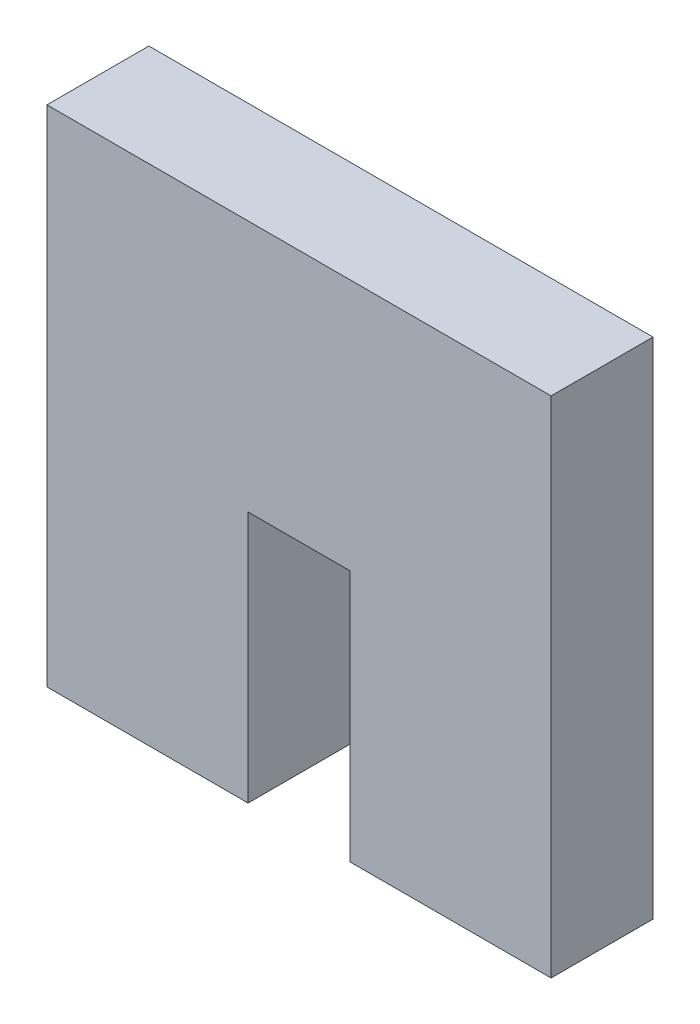
ISO-10303-21;
HEADER;
FILE_DESCRIPTION(('STEP AP214'),'2;1');
FILE_NAME('part.step','',(''),(''),'','','');
FILE_SCHEMA(('AUTOMOTIVE_DESIGN { 1 0 10303 214 1 1 1 1 }'));
ENDSEC;
DATA;
#1=APPLICATION_CONTEXT('core data for automotive mechanical design processes');
#2=APPLICATION_PROTOCOL_DEFINITION('international standard','automotive_design',2000,#1);
#3=PRODUCT_CONTEXT('',#1,'mechanical');
#4=PRODUCT('Part','Part','',(#3));
#5=PRODUCT_RELATED_PRODUCT_CATEGORY('part','',(#4));
#6=PRODUCT_DEFINITION_FORMATION('','',#4);
#7=PRODUCT_DEFINITION_CONTEXT('part definition',#1,'design');
#8=PRODUCT_DEFINITION('design','',#6,#7);
#9=PRODUCT_DEFINITION_SHAPE('','',#8);
#10=(LENGTH_UNIT() NAMED_UNIT(*) SI_UNIT(.MILLI.,.METRE.));
#11=(NAMED_UNIT(*) PLANE_ANGLE_UNIT() SI_UNIT($,.RADIAN.));
#12=(NAMED_UNIT(*) SI_UNIT($,.STERADIAN.) SOLID_ANGLE_UNIT());
#13=UNCERTAINTY_MEASURE_WITH_UNIT(LENGTH_MEASURE(1.E-05),#10,'distance_accuracy_value','');
#14=(GEOMETRIC_REPRESENTATION_CONTEXT(3) GLOBAL_UNCERTAINTY_ASSIGNED_CONTEXT((#13)) GLOBAL_UNIT_ASSIGNED_CONTEXT((#10,
#11,#12)) REPRESENTATION_CONTEXT('',''));
#15=CARTESIAN_POINT('',(0.,0.,0.));
#16=DIRECTION('',(0.,0.,1.));
#17=DIRECTION('',(1.,0.,0.));
#18=AXIS2_PLACEMENT_3D('',#15,#16,#17);
#19=CARTESIAN_POINT('',(0.,0.,4.318));
#20=DIRECTION('',(1.,0.,0.));
#21=DIRECTION('',(0.,0.,-1.));
#22=AXIS2_PLACEMENT_3D('',#19,#20,#21);
#23=PLANE('',#22);
#24=DIRECTION('',(0.,-1.,0.));
#25=VECTOR('',#24,1.);
#26=CARTESIAN_POINT('',(0.,0.,0.));
#27=LINE('',#26,#25);
#28=CARTESIAN_POINT('',(0.,21.36,0.));
#29=VERTEX_POINT('',#28);
#30=CARTESIAN_POINT('',(0.,0.,0.));
#31=VERTEX_POINT('',#30);
#32=EDGE_CURVE('E129',#29,#31,#27,.T.);
#33=ORIENTED_EDGE('',*,*,#32,.T.);
#34=DIRECTION('',(0.,0.,-1.));
#35=VECTOR('',#34,1.);
#36=CARTESIAN_POINT('',(0.,0.,4.318));
#37=LINE('',#36,#35);
#38=CARTESIAN_POINT('',(0.,0.,4.318));
#39=VERTEX_POINT('',#38);
#40=EDGE_CURVE('E11',#39,#31,#37,.T.);
#41=ORIENTED_EDGE('',*,*,#40,.F.);
#42=DIRECTION('',(0.,-1.,0.));
#43=VECTOR('',#42,1.);
#44=CARTESIAN_POINT('',(0.,0.,4.318));
#45=LINE('',#44,#43);
#46=CARTESIAN_POINT('',(0.,21.36,4.318));
#47=VERTEX_POINT('',#46);
#48=EDGE_CURVE('E143',#47,#39,#45,.T.);
#49=ORIENTED_EDGE('',*,*,#48,.F.);
#50=DIRECTION('',(0.,0.,-1.));
#51=VECTOR('',#50,1.);
#52=CARTESIAN_POINT('',(0.,21.36,4.318));
#53=LINE('',#52,#51);
#54=EDGE_CURVE('E125',#47,#29,#53,.T.);
#55=ORIENTED_EDGE('',*,*,#54,.T.);
#56=EDGE_LOOP('',(#33,#41,#49,#55));
#57=FACE_BOUND('',#56,.T.);
#58=ADVANCED_FACE('F33',(#57),#23,.F.);
#59=CARTESIAN_POINT('',(0.,0.,4.318));
#60=DIRECTION('',(0.,1.,0.));
#61=DIRECTION('',(0.,0.,1.));
#62=AXIS2_PLACEMENT_3D('',#59,#60,#61);
#63=PLANE('',#62);
#64=DIRECTION('',(1.,0.,0.));
#65=VECTOR('',#64,1.);
#66=CARTESIAN_POINT('',(0.,0.,0.));
#67=LINE('',#66,#65);
#68=CARTESIAN_POINT('',(8.521,0.,0.));
#69=VERTEX_POINT('',#68);
#70=EDGE_CURVE('E132',#31,#69,#67,.T.);
#71=ORIENTED_EDGE('',*,*,#70,.T.);
#72=DIRECTION('',(0.,0.,-1.));
#73=VECTOR('',#72,1.);
#74=CARTESIAN_POINT('',(8.521,0.,4.318));
#75=LINE('',#74,#73);
#76=CARTESIAN_POINT('',(8.521,0.,4.318));
#77=VERTEX_POINT('',#76);
#78=EDGE_CURVE('E41',#77,#69,#75,.T.);
#79=ORIENTED_EDGE('',*,*,#78,.F.);
#80=DIRECTION('',(1.,0.,0.));
#81=VECTOR('',#80,1.);
#82=CARTESIAN_POINT('',(0.,0.,4.318));
#83=LINE('',#82,#81);
#84=EDGE_CURVE('E92',#39,#77,#83,.T.);
#85=ORIENTED_EDGE('',*,*,#84,.F.);
#86=ORIENTED_EDGE('',*,*,#40,.T.);
#87=EDGE_LOOP('',(#71,#79,#85,#86));
#88=FACE_BOUND('',#87,.T.);
#89=ADVANCED_FACE('F178',(#88),#63,.F.);
#90=CARTESIAN_POINT('',(8.521,0.,4.318));
#91=DIRECTION('',(-1.,0.,0.));
#92=DIRECTION('',(0.,0.,1.));
#93=AXIS2_PLACEMENT_3D('',#90,#91,#92);
#94=PLANE('',#93);
#95=DIRECTION('',(0.,1.,0.));
#96=VECTOR('',#95,1.);
#97=CARTESIAN_POINT('',(8.521,0.,0.));
#98=LINE('',#97,#96);
#99=CARTESIAN_POINT('',(8.521,10.68,0.));
#100=VERTEX_POINT('',#99);
#101=EDGE_CURVE('E134',#69,#100,#98,.T.);
#102=ORIENTED_EDGE('',*,*,#101,.T.);
#103=DIRECTION('',(0.,0.,-1.));
#104=VECTOR('',#103,1.);
#105=CARTESIAN_POINT('',(8.521,10.68,4.318));
#106=LINE('',#105,#104);
#107=CARTESIAN_POINT('',(8.521,10.68,4.318));
#108=VERTEX_POINT('',#107);
#109=EDGE_CURVE('E150',#108,#100,#106,.T.);
#110=ORIENTED_EDGE('',*,*,#109,.F.);
#111=DIRECTION('',(0.,1.,0.));
#112=VECTOR('',#111,1.);
#113=CARTESIAN_POINT('',(8.521,0.,4.318));
#114=LINE('',#113,#112);
#115=EDGE_CURVE('E158',#77,#108,#114,.T.);
#116=ORIENTED_EDGE('',*,*,#115,.F.);
#117=ORIENTED_EDGE('',*,*,#78,.T.);
#118=EDGE_LOOP('',(#102,#110,#116,#117));
#119=FACE_BOUND('',#118,.T.);
#120=ADVANCED_FACE('F156',(#119),#94,.F.);
#121=CARTESIAN_POINT('',(8.521,10.68,4.318));
#122=DIRECTION('',(0.,1.,0.));
#123=DIRECTION('',(-1.,0.,0.));
#124=AXIS2_PLACEMENT_3D('',#121,#122,#123);
#125=PLANE('',#124);
#126=DIRECTION('',(1.,0.,0.));
#127=VECTOR('',#126,1.);
#128=CARTESIAN_POINT('',(8.521,10.68,0.));
#129=LINE('',#128,#127);
#130=CARTESIAN_POINT('',(12.839,10.68,0.));
#131=VERTEX_POINT('',#130);
#132=EDGE_CURVE('E136',#100,#131,#129,.T.);
#133=ORIENTED_EDGE('',*,*,#132,.T.);
#134=DIRECTION('',(0.,0.,-1.));
#135=VECTOR('',#134,1.);
#136=CARTESIAN_POINT('',(12.839,10.68,4.318));
#137=LINE('',#136,#135);
#138=CARTESIAN_POINT('',(12.839,10.68,4.318));
#139=VERTEX_POINT('',#138);
#140=EDGE_CURVE('E147',#139,#131,#137,.T.);
#141=ORIENTED_EDGE('',*,*,#140,.F.);
#142=DIRECTION('',(1.,0.,0.));
#143=VECTOR('',#142,1.);
#144=CARTESIAN_POINT('',(8.521,10.68,4.318));
#145=LINE('',#144,#143);
#146=EDGE_CURVE('E170',#108,#139,#145,.T.);
#147=ORIENTED_EDGE('',*,*,#146,.F.);
#148=ORIENTED_EDGE('',*,*,#109,.T.);
#149=EDGE_LOOP('',(#133,#141,#147,#148));
#150=FACE_BOUND('',#149,.T.);
#151=ADVANCED_FACE('F166',(#150),#125,.F.);
#152=CARTESIAN_POINT('',(12.839,0.,4.318));
#153=DIRECTION('',(1.,0.,0.));
#154=DIRECTION('',(0.,1.,0.));
#155=AXIS2_PLACEMENT_3D('',#152,#153,#154);
#156=PLANE('',#155);
#157=DIRECTION('',(0.,-1.,0.));
#158=VECTOR('',#157,1.);
#159=CARTESIAN_POINT('',(12.839,0.,0.));
#160=LINE('',#159,#158);
#161=CARTESIAN_POINT('',(12.839,0.,0.));
#162=VERTEX_POINT('',#161);
#163=EDGE_CURVE('E138',#131,#162,#160,.T.);
#164=ORIENTED_EDGE('',*,*,#163,.T.);
#165=DIRECTION('',(0.,0.,-1.));
#166=VECTOR('',#165,1.);
#167=CARTESIAN_POINT('',(12.839,0.,4.318));
#168=LINE('',#167,#166);
#169=CARTESIAN_POINT('',(12.839,0.,4.318));
#170=VERTEX_POINT('',#169);
#171=EDGE_CURVE('E120',#170,#162,#168,.T.);
#172=ORIENTED_EDGE('',*,*,#171,.F.);
#173=DIRECTION('',(0.,-1.,0.));
#174=VECTOR('',#173,1.);
#175=CARTESIAN_POINT('',(12.839,0.,4.318));
#176=LINE('',#175,#174);
#177=EDGE_CURVE('E111',#139,#170,#176,.T.);
#178=ORIENTED_EDGE('',*,*,#177,.F.);
#179=ORIENTED_EDGE('',*,*,#140,.T.);
#180=EDGE_LOOP('',(#164,#172,#178,#179));
#181=FACE_BOUND('',#180,.T.);
#182=ADVANCED_FACE('F169',(#181),#156,.F.);
#183=CARTESIAN_POINT('',(12.839,0.,4.318));
#184=DIRECTION('',(0.,1.,0.));
#185=DIRECTION('',(0.,0.,1.));
#186=AXIS2_PLACEMENT_3D('',#183,#184,#185);
#187=PLANE('',#186);
#188=DIRECTION('',(1.,0.,0.));
#189=VECTOR('',#188,1.);
#190=CARTESIAN_POINT('',(12.839,0.,0.));
#191=LINE('',#190,#189);
#192=CARTESIAN_POINT('',(21.36,0.,0.));
#193=VERTEX_POINT('',#192);
#194=EDGE_CURVE('E119',#162,#193,#191,.T.);
#195=ORIENTED_EDGE('',*,*,#194,.T.);
#196=DIRECTION('',(0.,0.,-1.));
#197=VECTOR('',#196,1.);
#198=CARTESIAN_POINT('',(21.36,0.,4.318));
#199=LINE('',#198,#197);
#200=CARTESIAN_POINT('',(21.36,0.,4.318));
#201=VERTEX_POINT('',#200);
#202=EDGE_CURVE('E116',#201,#193,#199,.T.);
#203=ORIENTED_EDGE('',*,*,#202,.F.);
#204=DIRECTION('',(1.,0.,0.));
#205=VECTOR('',#204,1.);
#206=CARTESIAN_POINT('',(12.839,0.,4.318));
#207=LINE('',#206,#205);
#208=EDGE_CURVE('E105',#170,#201,#207,.T.);
#209=ORIENTED_EDGE('',*,*,#208,.F.);
#210=ORIENTED_EDGE('',*,*,#171,.T.);
#211=EDGE_LOOP('',(#195,#203,#209,#210));
#212=FACE_BOUND('',#211,.T.);
#213=ADVANCED_FACE('F117',(#212),#187,.F.);
#214=CARTESIAN_POINT('',(21.36,0.,4.318));
#215=DIRECTION('',(-1.,0.,0.));
#216=DIRECTION('',(0.,-1.,0.));
#217=AXIS2_PLACEMENT_3D('',#214,#215,#216);
#218=PLANE('',#217);
#219=DIRECTION('',(0.,1.,0.));
#220=VECTOR('',#219,1.);
#221=CARTESIAN_POINT('',(21.36,0.,0.));
#222=LINE('',#221,#220);
#223=CARTESIAN_POINT('',(21.36,21.36,0.));
#224=VERTEX_POINT('',#223);
#225=EDGE_CURVE('E78',#193,#224,#222,.T.);
#226=ORIENTED_EDGE('',*,*,#225,.T.);
#227=DIRECTION('',(0.,0.,-1.));
#228=VECTOR('',#227,1.);
#229=CARTESIAN_POINT('',(21.36,21.36,4.318));
#230=LINE('',#229,#228);
#231=CARTESIAN_POINT('',(21.36,21.36,4.318));
#232=VERTEX_POINT('',#231);
#233=EDGE_CURVE('E121',#232,#224,#230,.T.);
#234=ORIENTED_EDGE('',*,*,#233,.F.);
#235=DIRECTION('',(0.,1.,0.));
#236=VECTOR('',#235,1.);
#237=CARTESIAN_POINT('',(21.36,0.,4.318));
#238=LINE('',#237,#236);
#239=EDGE_CURVE('E109',#201,#232,#238,.T.);
#240=ORIENTED_EDGE('',*,*,#239,.F.);
#241=ORIENTED_EDGE('',*,*,#202,.T.);
#242=EDGE_LOOP('',(#226,#234,#240,#241));
#243=FACE_BOUND('',#242,.T.);
#244=ADVANCED_FACE('F123',(#243),#218,.F.);
#245=CARTESIAN_POINT('',(0.,21.36,4.318));
#246=DIRECTION('',(0.,-1.,0.));
#247=DIRECTION('',(0.,0.,-1.));
#248=AXIS2_PLACEMENT_3D('',#245,#246,#247);
#249=PLANE('',#248);
#250=DIRECTION('',(-1.,0.,0.));
#251=VECTOR('',#250,1.);
#252=CARTESIAN_POINT('',(0.,21.36,0.));
#253=LINE('',#252,#251);
#254=EDGE_CURVE('E84',#224,#29,#253,.T.);
#255=ORIENTED_EDGE('',*,*,#254,.T.);
#256=ORIENTED_EDGE('',*,*,#54,.F.);
#257=DIRECTION('',(-1.,0.,0.));
#258=VECTOR('',#257,1.);
#259=CARTESIAN_POINT('',(0.,21.36,4.318));
#260=LINE('',#259,#258);
#261=EDGE_CURVE('E49',#232,#47,#260,.T.);
#262=ORIENTED_EDGE('',*,*,#261,.F.);
#263=ORIENTED_EDGE('',*,*,#233,.T.);
#264=EDGE_LOOP('',(#255,#256,#262,#263));
#265=FACE_BOUND('',#264,.T.);
#266=ADVANCED_FACE('F194',(#265),#249,.F.);
#267=CARTESIAN_POINT('',(0.,21.36,4.318));
#268=DIRECTION('',(0.,0.,-1.));
#269=DIRECTION('',(-1.,0.,0.));
#270=AXIS2_PLACEMENT_3D('',#267,#268,#269);
#271=PLANE('',#270);
#272=ORIENTED_EDGE('',*,*,#48,.T.);
#273=ORIENTED_EDGE('',*,*,#84,.T.);
#274=ORIENTED_EDGE('',*,*,#115,.T.);
#275=ORIENTED_EDGE('',*,*,#146,.T.);
#276=ORIENTED_EDGE('',*,*,#177,.T.);
#277=ORIENTED_EDGE('',*,*,#208,.T.);
#278=ORIENTED_EDGE('',*,*,#239,.T.);
#279=ORIENTED_EDGE('',*,*,#261,.T.);
#280=EDGE_LOOP('',(#272,#273,#274,#275,#276,#277,#278,#279));
#281=FACE_BOUND('',#280,.T.);
#282=ADVANCED_FACE('F107',(#281),#271,.F.);
#283=CARTESIAN_POINT('',(0.,21.36,0.));
#284=DIRECTION('',(0.,0.,-1.));
#285=DIRECTION('',(-1.,0.,0.));
#286=AXIS2_PLACEMENT_3D('',#283,#284,#285);
#287=PLANE('',#286);
#288=ORIENTED_EDGE('',*,*,#32,.F.);
#289=ORIENTED_EDGE('',*,*,#254,.F.);
#290=ORIENTED_EDGE('',*,*,#225,.F.);
#291=ORIENTED_EDGE('',*,*,#194,.F.);
#292=ORIENTED_EDGE('',*,*,#163,.F.);
#293=ORIENTED_EDGE('',*,*,#132,.F.);
#294=ORIENTED_EDGE('',*,*,#101,.F.);
#295=ORIENTED_EDGE('',*,*,#70,.F.);
#296=EDGE_LOOP('',(#288,#289,#290,#291,#292,#293,#294,#295));
#297=FACE_BOUND('',#296,.T.);
#298=ADVANCED_FACE('F162',(#297),#287,.T.);
#299=CLOSED_SHELL('',(#58,#89,#120,#151,#182,#213,#244,#266,#282,#298));
#300=MANIFOLD_SOLID_BREP('B2',#299);
#301=ADVANCED_BREP_SHAPE_REPRESENTATION('',(#18,#300),#14);
#302=SHAPE_DEFINITION_REPRESENTATION(#9,#301);
ENDSEC;
END-ISO-10303-21;
